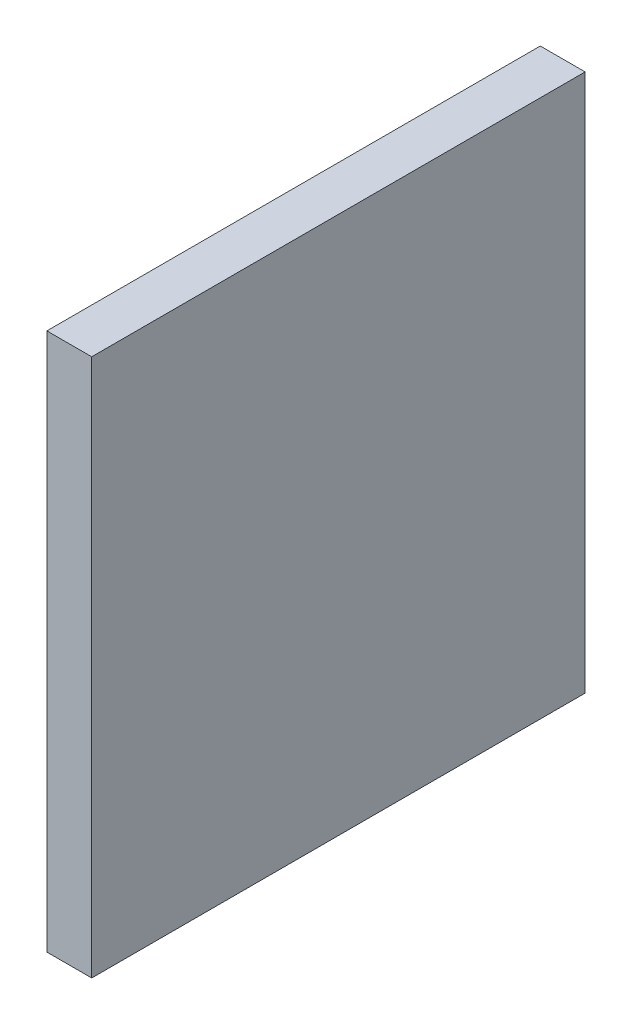
ISO-10303-21;
HEADER;
FILE_DESCRIPTION(('STEP AP214'),'2;1');
FILE_NAME('part.step','',(''),(''),'','','');
FILE_SCHEMA(('AUTOMOTIVE_DESIGN { 1 0 10303 214 1 1 1 1 }'));
ENDSEC;
DATA;
#1=APPLICATION_CONTEXT('core data for automotive mechanical design processes');
#2=APPLICATION_PROTOCOL_DEFINITION('international standard','automotive_design',2000,#1);
#3=PRODUCT_CONTEXT('',#1,'mechanical');
#4=PRODUCT('Part','Part','',(#3));
#5=PRODUCT_RELATED_PRODUCT_CATEGORY('part','',(#4));
#6=PRODUCT_DEFINITION_FORMATION('','',#4);
#7=PRODUCT_DEFINITION_CONTEXT('part definition',#1,'design');
#8=PRODUCT_DEFINITION('design','',#6,#7);
#9=PRODUCT_DEFINITION_SHAPE('','',#8);
#10=(LENGTH_UNIT() NAMED_UNIT(*) SI_UNIT(.MILLI.,.METRE.));
#11=(NAMED_UNIT(*) PLANE_ANGLE_UNIT() SI_UNIT($,.RADIAN.));
#12=(NAMED_UNIT(*) SI_UNIT($,.STERADIAN.) SOLID_ANGLE_UNIT());
#13=UNCERTAINTY_MEASURE_WITH_UNIT(LENGTH_MEASURE(1.E-05),#10,'distance_accuracy_value','');
#14=(GEOMETRIC_REPRESENTATION_CONTEXT(3) GLOBAL_UNCERTAINTY_ASSIGNED_CONTEXT((#13)) GLOBAL_UNIT_ASSIGNED_CONTEXT((#10,
#11,#12)) REPRESENTATION_CONTEXT('',''));
#15=CARTESIAN_POINT('',(0.,0.,0.));
#16=DIRECTION('',(0.,0.,1.));
#17=DIRECTION('',(1.,0.,0.));
#18=AXIS2_PLACEMENT_3D('',#15,#16,#17);
#19=CARTESIAN_POINT('',(19.27,3.370879230954,5.7));
#20=DIRECTION('',(-1.,0.,0.));
#21=DIRECTION('',(0.,0.,1.));
#22=AXIS2_PLACEMENT_3D('',#19,#20,#21);
#23=PLANE('',#22);
#24=DIRECTION('',(0.,1.,0.));
#25=VECTOR('',#24,1.);
#26=CARTESIAN_POINT('',(19.27,5.17,4.05));
#27=LINE('',#26,#25);
#28=CARTESIAN_POINT('',(19.27,5.17,4.05));
#29=VERTEX_POINT('',#28);
#30=CARTESIAN_POINT('',(19.27,1.571758461908,4.05));
#31=VERTEX_POINT('',#30);
#32=EDGE_CURVE('E79',#29,#31,#27,.F.);
#33=ORIENTED_EDGE('',*,*,#32,.F.);
#34=DIRECTION('',(0.,0.,1.));
#35=VECTOR('',#34,1.);
#36=CARTESIAN_POINT('',(19.27,5.17,7.35));
#37=LINE('',#36,#35);
#38=CARTESIAN_POINT('',(19.27,5.17,7.35));
#39=VERTEX_POINT('',#38);
#40=EDGE_CURVE('E55',#39,#29,#37,.F.);
#41=ORIENTED_EDGE('',*,*,#40,.F.);
#42=DIRECTION('',(0.,1.,0.));
#43=VECTOR('',#42,1.);
#44=CARTESIAN_POINT('',(19.27,1.571758461908,7.35));
#45=LINE('',#44,#43);
#46=CARTESIAN_POINT('',(19.27,1.571758461908,7.35));
#47=VERTEX_POINT('',#46);
#48=EDGE_CURVE('E57',#47,#39,#45,.T.);
#49=ORIENTED_EDGE('',*,*,#48,.F.);
#50=DIRECTION('',(0.,0.,-1.));
#51=VECTOR('',#50,1.);
#52=CARTESIAN_POINT('',(19.27,1.571758461908,4.05));
#53=LINE('',#52,#51);
#54=EDGE_CURVE('E20',#31,#47,#53,.F.);
#55=ORIENTED_EDGE('',*,*,#54,.F.);
#56=EDGE_LOOP('',(#33,#41,#49,#55));
#57=FACE_BOUND('',#56,.T.);
#58=ADVANCED_FACE('F17',(#57),#23,.F.);
#59=CARTESIAN_POINT('',(19.27,1.571758461908,4.05));
#60=DIRECTION('',(0.,-1.,0.));
#61=DIRECTION('',(0.,0.,-1.));
#62=AXIS2_PLACEMENT_3D('',#59,#60,#61);
#63=PLANE('',#62);
#64=DIRECTION('',(0.,0.,1.));
#65=VECTOR('',#64,1.);
#66=CARTESIAN_POINT('',(18.97,1.571758461908,5.7));
#67=LINE('',#66,#65);
#68=CARTESIAN_POINT('',(18.97,1.571758461908,4.05));
#69=VERTEX_POINT('',#68);
#70=CARTESIAN_POINT('',(18.97,1.571758461908,7.35));
#71=VERTEX_POINT('',#70);
#72=EDGE_CURVE('E83',#69,#71,#67,.T.);
#73=ORIENTED_EDGE('',*,*,#72,.F.);
#74=DIRECTION('',(-1.,0.,0.));
#75=VECTOR('',#74,1.);
#76=CARTESIAN_POINT('',(19.27,1.571758461908,4.05));
#77=LINE('',#76,#75);
#78=EDGE_CURVE('E68',#31,#69,#77,.T.);
#79=ORIENTED_EDGE('',*,*,#78,.F.);
#80=ORIENTED_EDGE('',*,*,#54,.T.);
#81=DIRECTION('',(1.,0.,0.));
#82=VECTOR('',#81,1.);
#83=CARTESIAN_POINT('',(19.27,1.571758461908,7.35));
#84=LINE('',#83,#82);
#85=EDGE_CURVE('E63',#71,#47,#84,.T.);
#86=ORIENTED_EDGE('',*,*,#85,.F.);
#87=EDGE_LOOP('',(#73,#79,#80,#86));
#88=FACE_BOUND('',#87,.T.);
#89=ADVANCED_FACE('F65',(#88),#63,.T.);
#90=CARTESIAN_POINT('',(19.27,1.571758461908,7.35));
#91=DIRECTION('',(0.,0.,1.));
#92=DIRECTION('',(1.,0.,0.));
#93=AXIS2_PLACEMENT_3D('',#90,#91,#92);
#94=PLANE('',#93);
#95=DIRECTION('',(0.,1.,0.));
#96=VECTOR('',#95,1.);
#97=CARTESIAN_POINT('',(18.97,3.370879230954,7.35));
#98=LINE('',#97,#96);
#99=CARTESIAN_POINT('',(18.97,5.17,7.35));
#100=VERTEX_POINT('',#99);
#101=EDGE_CURVE('E72',#71,#100,#98,.T.);
#102=ORIENTED_EDGE('',*,*,#101,.F.);
#103=ORIENTED_EDGE('',*,*,#85,.T.);
#104=ORIENTED_EDGE('',*,*,#48,.T.);
#105=DIRECTION('',(1.,0.,0.));
#106=VECTOR('',#105,1.);
#107=CARTESIAN_POINT('',(19.27,5.17,7.35));
#108=LINE('',#107,#106);
#109=EDGE_CURVE('E75',#100,#39,#108,.T.);
#110=ORIENTED_EDGE('',*,*,#109,.F.);
#111=EDGE_LOOP('',(#102,#103,#104,#110));
#112=FACE_BOUND('',#111,.T.);
#113=ADVANCED_FACE('F70',(#112),#94,.T.);
#114=CARTESIAN_POINT('',(19.27,5.17,7.35));
#115=DIRECTION('',(0.,1.,0.));
#116=DIRECTION('',(0.,0.,1.));
#117=AXIS2_PLACEMENT_3D('',#114,#115,#116);
#118=PLANE('',#117);
#119=DIRECTION('',(0.,0.,1.));
#120=VECTOR('',#119,1.);
#121=CARTESIAN_POINT('',(18.97,5.17,5.7));
#122=LINE('',#121,#120);
#123=CARTESIAN_POINT('',(18.97,5.17,4.05));
#124=VERTEX_POINT('',#123);
#125=EDGE_CURVE('E26',#100,#124,#122,.F.);
#126=ORIENTED_EDGE('',*,*,#125,.F.);
#127=ORIENTED_EDGE('',*,*,#109,.T.);
#128=ORIENTED_EDGE('',*,*,#40,.T.);
#129=DIRECTION('',(-1.,0.,0.));
#130=VECTOR('',#129,1.);
#131=CARTESIAN_POINT('',(19.27,5.17,4.05));
#132=LINE('',#131,#130);
#133=EDGE_CURVE('E35',#124,#29,#132,.F.);
#134=ORIENTED_EDGE('',*,*,#133,.F.);
#135=EDGE_LOOP('',(#126,#127,#128,#134));
#136=FACE_BOUND('',#135,.T.);
#137=ADVANCED_FACE('F89',(#136),#118,.T.);
#138=CARTESIAN_POINT('',(19.27,5.17,4.05));
#139=DIRECTION('',(0.,0.,-1.));
#140=DIRECTION('',(-1.,0.,0.));
#141=AXIS2_PLACEMENT_3D('',#138,#139,#140);
#142=PLANE('',#141);
#143=DIRECTION('',(0.,1.,0.));
#144=VECTOR('',#143,1.);
#145=CARTESIAN_POINT('',(18.97,3.370879230954,4.05));
#146=LINE('',#145,#144);
#147=EDGE_CURVE('E11',#124,#69,#146,.F.);
#148=ORIENTED_EDGE('',*,*,#147,.F.);
#149=ORIENTED_EDGE('',*,*,#133,.T.);
#150=ORIENTED_EDGE('',*,*,#32,.T.);
#151=ORIENTED_EDGE('',*,*,#78,.T.);
#152=EDGE_LOOP('',(#148,#149,#150,#151));
#153=FACE_BOUND('',#152,.T.);
#154=ADVANCED_FACE('F91',(#153),#142,.T.);
#155=CARTESIAN_POINT('',(18.97,3.370879230954,5.7));
#156=DIRECTION('',(-1.,0.,0.));
#157=DIRECTION('',(0.,0.,1.));
#158=AXIS2_PLACEMENT_3D('',#155,#156,#157);
#159=PLANE('',#158);
#160=ORIENTED_EDGE('',*,*,#125,.T.);
#161=ORIENTED_EDGE('',*,*,#147,.T.);
#162=ORIENTED_EDGE('',*,*,#72,.T.);
#163=ORIENTED_EDGE('',*,*,#101,.T.);
#164=EDGE_LOOP('',(#160,#161,#162,#163));
#165=FACE_BOUND('',#164,.T.);
#166=ADVANCED_FACE('F88',(#165),#159,.T.);
#167=CLOSED_SHELL('',(#58,#89,#113,#137,#154,#166));
#168=MANIFOLD_SOLID_BREP('B1',#167);
#169=ADVANCED_BREP_SHAPE_REPRESENTATION('',(#18,#168),#14);
#170=SHAPE_DEFINITION_REPRESENTATION(#9,#169);
ENDSEC;
END-ISO-10303-21;
